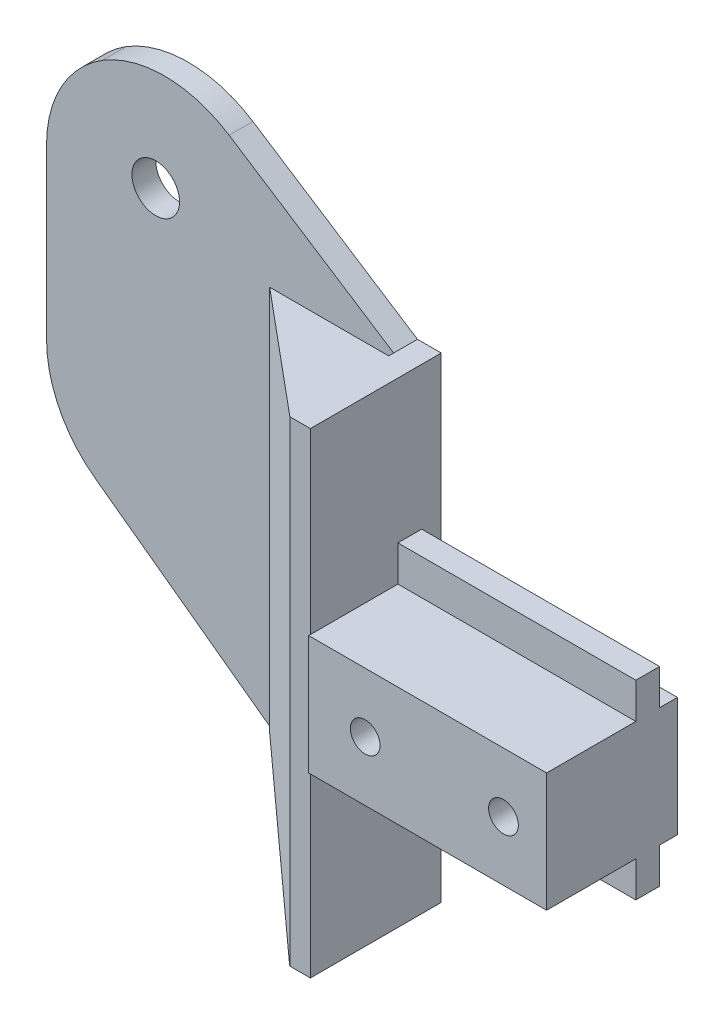
ISO-10303-21;
HEADER;
FILE_DESCRIPTION(('STEP AP214'),'2;1');
FILE_NAME('part.step','',(''),(''),'','','');
FILE_SCHEMA(('AUTOMOTIVE_DESIGN { 1 0 10303 214 1 1 1 1 }'));
ENDSEC;
DATA;
#1=APPLICATION_CONTEXT('core data for automotive mechanical design processes');
#2=APPLICATION_PROTOCOL_DEFINITION('international standard','automotive_design',2000,#1);
#3=PRODUCT_CONTEXT('',#1,'mechanical');
#4=PRODUCT('Part','Part','',(#3));
#5=PRODUCT_RELATED_PRODUCT_CATEGORY('part','',(#4));
#6=PRODUCT_DEFINITION_FORMATION('','',#4);
#7=PRODUCT_DEFINITION_CONTEXT('part definition',#1,'design');
#8=PRODUCT_DEFINITION('design','',#6,#7);
#9=PRODUCT_DEFINITION_SHAPE('','',#8);
#10=(LENGTH_UNIT() NAMED_UNIT(*) SI_UNIT(.MILLI.,.METRE.));
#11=(NAMED_UNIT(*) PLANE_ANGLE_UNIT() SI_UNIT($,.RADIAN.));
#12=(NAMED_UNIT(*) SI_UNIT($,.STERADIAN.) SOLID_ANGLE_UNIT());
#13=UNCERTAINTY_MEASURE_WITH_UNIT(LENGTH_MEASURE(1.E-05),#10,'distance_accuracy_value','');
#14=(GEOMETRIC_REPRESENTATION_CONTEXT(3) GLOBAL_UNCERTAINTY_ASSIGNED_CONTEXT((#13)) GLOBAL_UNIT_ASSIGNED_CONTEXT((#10,
#11,#12)) REPRESENTATION_CONTEXT('',''));
#15=CARTESIAN_POINT('',(0.,0.,0.));
#16=DIRECTION('',(0.,0.,1.));
#17=DIRECTION('',(1.,0.,0.));
#18=AXIS2_PLACEMENT_3D('',#15,#16,#17);
#19=CARTESIAN_POINT('',(-12.,0.,0.));
#20=DIRECTION('',(1.,0.,0.));
#21=DIRECTION('',(0.,0.,-1.));
#22=AXIS2_PLACEMENT_3D('',#19,#20,#21);
#23=PLANE('',#22);
#24=DIRECTION('',(0.,-1.,0.));
#25=VECTOR('',#24,1.);
#26=CARTESIAN_POINT('',(-12.,20.,2.27794764808502));
#27=LINE('',#26,#25);
#28=CARTESIAN_POINT('',(-12.,20.,2.27794764808502));
#29=VERTEX_POINT('',#28);
#30=CARTESIAN_POINT('',(-12.,-19.9305207658601,2.27794764808502));
#31=VERTEX_POINT('',#30);
#32=EDGE_CURVE('E221',#29,#31,#27,.T.);
#33=ORIENTED_EDGE('',*,*,#32,.F.);
#34=DIRECTION('',(0.,0.,-1.));
#35=VECTOR('',#34,1.);
#36=CARTESIAN_POINT('',(-12.,20.,10.8575227914939));
#37=LINE('',#36,#35);
#38=CARTESIAN_POINT('',(-12.,20.,1.85752279149395));
#39=VERTEX_POINT('',#38);
#40=EDGE_CURVE('E268',#29,#39,#37,.T.);
#41=ORIENTED_EDGE('',*,*,#40,.T.);
#42=DIRECTION('',(0.,1.,0.));
#43=VECTOR('',#42,1.);
#44=CARTESIAN_POINT('',(-12.,-20.,1.85752279149395));
#45=LINE('',#44,#43);
#46=CARTESIAN_POINT('',(-12.,-20.,1.85752279149395));
#47=VERTEX_POINT('',#46);
#48=EDGE_CURVE('E259',#47,#39,#45,.T.);
#49=ORIENTED_EDGE('',*,*,#48,.F.);
#50=DIRECTION('',(0.,0.,1.));
#51=VECTOR('',#50,1.);
#52=CARTESIAN_POINT('',(-12.,-20.,10.857522791494));
#53=LINE('',#52,#51);
#54=CARTESIAN_POINT('',(-12.,-20.,2.27794764808502));
#55=VERTEX_POINT('',#54);
#56=EDGE_CURVE('E263',#47,#55,#53,.T.);
#57=ORIENTED_EDGE('',*,*,#56,.T.);
#58=DIRECTION('',(0.,-1.,0.));
#59=VECTOR('',#58,1.);
#60=CARTESIAN_POINT('',(-12.,0.,2.27794764808502));
#61=LINE('',#60,#59);
#62=EDGE_CURVE('E438',#31,#55,#61,.T.);
#63=ORIENTED_EDGE('',*,*,#62,.F.);
#64=EDGE_LOOP('',(#33,#41,#49,#57,#63));
#65=FACE_BOUND('',#64,.T.);
#66=ADVANCED_FACE('F33',(#65),#23,.F.);
#67=CARTESIAN_POINT('',(-10.,5.,11.));
#68=DIRECTION('',(1.,0.,0.));
#69=DIRECTION('',(0.,0.,-1.));
#70=AXIS2_PLACEMENT_3D('',#67,#68,#69);
#71=PLANE('',#70);
#72=DIRECTION('',(0.,1.,0.));
#73=VECTOR('',#72,1.);
#74=CARTESIAN_POINT('',(-10.,20.,10.8575227914939));
#75=LINE('',#74,#73);
#76=CARTESIAN_POINT('',(-10.,-5.,10.857522791494));
#77=VERTEX_POINT('',#76);
#78=CARTESIAN_POINT('',(-10.,5.,10.857522791494));
#79=VERTEX_POINT('',#78);
#80=EDGE_CURVE('E280',#77,#79,#75,.T.);
#81=ORIENTED_EDGE('',*,*,#80,.F.);
#82=DIRECTION('',(0.,0.,-1.));
#83=VECTOR('',#82,1.);
#84=CARTESIAN_POINT('',(-10.,-5.,11.));
#85=LINE('',#84,#83);
#86=CARTESIAN_POINT('',(-10.,-5.,11.));
#87=VERTEX_POINT('',#86);
#88=EDGE_CURVE('E366',#87,#77,#85,.T.);
#89=ORIENTED_EDGE('',*,*,#88,.F.);
#90=DIRECTION('',(0.,-1.,0.));
#91=VECTOR('',#90,1.);
#92=CARTESIAN_POINT('',(-10.,5.,11.));
#93=LINE('',#92,#91);
#94=CARTESIAN_POINT('',(-10.,5.,11.));
#95=VERTEX_POINT('',#94);
#96=EDGE_CURVE('E334',#95,#87,#93,.T.);
#97=ORIENTED_EDGE('',*,*,#96,.F.);
#98=DIRECTION('',(0.,0.,-1.));
#99=VECTOR('',#98,1.);
#100=CARTESIAN_POINT('',(-10.,5.,11.));
#101=LINE('',#100,#99);
#102=EDGE_CURVE('E354',#95,#79,#101,.T.);
#103=ORIENTED_EDGE('',*,*,#102,.T.);
#104=EDGE_LOOP('',(#81,#89,#97,#103));
#105=FACE_BOUND('',#104,.T.);
#106=ADVANCED_FACE('F461',(#105),#71,.F.);
#107=CARTESIAN_POINT('',(10.,-5.,11.));
#108=DIRECTION('',(0.,1.,0.));
#109=DIRECTION('',(0.,0.,1.));
#110=AXIS2_PLACEMENT_3D('',#107,#108,#109);
#111=PLANE('',#110);
#112=ORIENTED_EDGE('',*,*,#88,.T.);
#113=CARTESIAN_POINT('',(-10.,-5.,3.5));
#114=VERTEX_POINT('',#113);
#115=EDGE_CURVE('E370',#77,#114,#85,.T.);
#116=ORIENTED_EDGE('',*,*,#115,.T.);
#117=DIRECTION('',(1.,0.,0.));
#118=VECTOR('',#117,1.);
#119=CARTESIAN_POINT('',(10.,-5.,3.5));
#120=LINE('',#119,#118);
#121=CARTESIAN_POINT('',(10.,-5.,3.5));
#122=VERTEX_POINT('',#121);
#123=EDGE_CURVE('E330',#114,#122,#120,.T.);
#124=ORIENTED_EDGE('',*,*,#123,.T.);
#125=DIRECTION('',(0.,0.,-1.));
#126=VECTOR('',#125,1.);
#127=CARTESIAN_POINT('',(10.,-5.,11.));
#128=LINE('',#127,#126);
#129=CARTESIAN_POINT('',(10.,-5.,11.));
#130=VERTEX_POINT('',#129);
#131=EDGE_CURVE('E362',#130,#122,#128,.T.);
#132=ORIENTED_EDGE('',*,*,#131,.F.);
#133=DIRECTION('',(1.,0.,0.));
#134=VECTOR('',#133,1.);
#135=CARTESIAN_POINT('',(10.,-5.,11.));
#136=LINE('',#135,#134);
#137=EDGE_CURVE('E337',#87,#130,#136,.T.);
#138=ORIENTED_EDGE('',*,*,#137,.F.);
#139=EDGE_LOOP('',(#112,#116,#124,#132,#138));
#140=FACE_BOUND('',#139,.T.);
#141=ADVANCED_FACE('F466',(#140),#111,.F.);
#142=CARTESIAN_POINT('',(10.,5.,11.));
#143=DIRECTION('',(0.,-1.,0.));
#144=DIRECTION('',(0.,0.,-1.));
#145=AXIS2_PLACEMENT_3D('',#142,#143,#144);
#146=PLANE('',#145);
#147=DIRECTION('',(0.,0.,-1.));
#148=VECTOR('',#147,1.);
#149=CARTESIAN_POINT('',(10.,5.,11.));
#150=LINE('',#149,#148);
#151=CARTESIAN_POINT('',(10.,5.,11.));
#152=VERTEX_POINT('',#151);
#153=CARTESIAN_POINT('',(10.,5.,3.5));
#154=VERTEX_POINT('',#153);
#155=EDGE_CURVE('E358',#152,#154,#150,.T.);
#156=ORIENTED_EDGE('',*,*,#155,.T.);
#157=DIRECTION('',(-1.,0.,0.));
#158=VECTOR('',#157,1.);
#159=CARTESIAN_POINT('',(10.,5.,3.5));
#160=LINE('',#159,#158);
#161=CARTESIAN_POINT('',(-10.,5.,3.5));
#162=VERTEX_POINT('',#161);
#163=EDGE_CURVE('E373',#154,#162,#160,.T.);
#164=ORIENTED_EDGE('',*,*,#163,.T.);
#165=EDGE_CURVE('E357',#79,#162,#101,.T.);
#166=ORIENTED_EDGE('',*,*,#165,.F.);
#167=ORIENTED_EDGE('',*,*,#102,.F.);
#168=DIRECTION('',(-1.,0.,0.));
#169=VECTOR('',#168,1.);
#170=CARTESIAN_POINT('',(10.,5.,11.));
#171=LINE('',#170,#169);
#172=EDGE_CURVE('E342',#152,#95,#171,.T.);
#173=ORIENTED_EDGE('',*,*,#172,.F.);
#174=EDGE_LOOP('',(#156,#164,#166,#167,#173));
#175=FACE_BOUND('',#174,.T.);
#176=ADVANCED_FACE('F475',(#175),#146,.F.);
#177=CARTESIAN_POINT('',(10.,-5.,1.5));
#178=VERTEX_POINT('',#177);
#179=CARTESIAN_POINT('',(10.,-5.,0.));
#180=VERTEX_POINT('',#179);
#181=EDGE_CURVE('E361',#178,#180,#128,.T.);
#182=ORIENTED_EDGE('',*,*,#181,.F.);
#183=DIRECTION('',(-1.,0.,0.));
#184=VECTOR('',#183,1.);
#185=CARTESIAN_POINT('',(10.,-5.,1.5));
#186=LINE('',#185,#184);
#187=CARTESIAN_POINT('',(-10.,-5.,1.5));
#188=VERTEX_POINT('',#187);
#189=EDGE_CURVE('E316',#178,#188,#186,.T.);
#190=ORIENTED_EDGE('',*,*,#189,.T.);
#191=CARTESIAN_POINT('',(-10.,-5.,0.));
#192=VERTEX_POINT('',#191);
#193=EDGE_CURVE('E365',#188,#192,#85,.T.);
#194=ORIENTED_EDGE('',*,*,#193,.T.);
#195=DIRECTION('',(1.,0.,0.));
#196=VECTOR('',#195,1.);
#197=CARTESIAN_POINT('',(10.,-5.,0.));
#198=LINE('',#197,#196);
#199=EDGE_CURVE('E347',#192,#180,#198,.T.);
#200=ORIENTED_EDGE('',*,*,#199,.T.);
#201=EDGE_LOOP('',(#182,#190,#194,#200));
#202=FACE_BOUND('',#201,.T.);
#203=ADVANCED_FACE('F563',(#202),#111,.F.);
#204=CARTESIAN_POINT('',(10.,5.,11.));
#205=DIRECTION('',(-1.,0.,0.));
#206=DIRECTION('',(0.,0.,1.));
#207=AXIS2_PLACEMENT_3D('',#204,#205,#206);
#208=PLANE('',#207);
#209=CARTESIAN_POINT('',(10.,5.,1.5));
#210=VERTEX_POINT('',#209);
#211=CARTESIAN_POINT('',(10.,5.,0.));
#212=VERTEX_POINT('',#211);
#213=EDGE_CURVE('E356',#210,#212,#150,.T.);
#214=ORIENTED_EDGE('',*,*,#213,.F.);
#215=DIRECTION('',(0.,1.,0.));
#216=VECTOR('',#215,1.);
#217=CARTESIAN_POINT('',(10.,-8.,1.5));
#218=LINE('',#217,#216);
#219=CARTESIAN_POINT('',(10.,8.,1.5));
#220=VERTEX_POINT('',#219);
#221=EDGE_CURVE('E313',#210,#220,#218,.T.);
#222=ORIENTED_EDGE('',*,*,#221,.T.);
#223=DIRECTION('',(0.,0.,-1.));
#224=VECTOR('',#223,1.);
#225=CARTESIAN_POINT('',(10.,8.,1.5));
#226=LINE('',#225,#224);
#227=CARTESIAN_POINT('',(10.,8.,3.5));
#228=VERTEX_POINT('',#227);
#229=EDGE_CURVE('E290',#228,#220,#226,.T.);
#230=ORIENTED_EDGE('',*,*,#229,.F.);
#231=DIRECTION('',(0.,1.,0.));
#232=VECTOR('',#231,1.);
#233=CARTESIAN_POINT('',(10.,-8.,3.5));
#234=LINE('',#233,#232);
#235=EDGE_CURVE('E317',#154,#228,#234,.T.);
#236=ORIENTED_EDGE('',*,*,#235,.F.);
#237=ORIENTED_EDGE('',*,*,#155,.F.);
#238=DIRECTION('',(0.,1.,0.));
#239=VECTOR('',#238,1.);
#240=CARTESIAN_POINT('',(10.,5.,11.));
#241=LINE('',#240,#239);
#242=EDGE_CURVE('E340',#130,#152,#241,.T.);
#243=ORIENTED_EDGE('',*,*,#242,.F.);
#244=ORIENTED_EDGE('',*,*,#131,.T.);
#245=CARTESIAN_POINT('',(10.,-8.,3.5));
#246=VERTEX_POINT('',#245);
#247=EDGE_CURVE('E314',#246,#122,#234,.T.);
#248=ORIENTED_EDGE('',*,*,#247,.F.);
#249=DIRECTION('',(0.,0.,-1.));
#250=VECTOR('',#249,1.);
#251=CARTESIAN_POINT('',(10.,-8.,1.5));
#252=LINE('',#251,#250);
#253=CARTESIAN_POINT('',(10.,-8.,1.5));
#254=VERTEX_POINT('',#253);
#255=EDGE_CURVE('E301',#246,#254,#252,.T.);
#256=ORIENTED_EDGE('',*,*,#255,.T.);
#257=EDGE_CURVE('E325',#254,#178,#218,.T.);
#258=ORIENTED_EDGE('',*,*,#257,.T.);
#259=ORIENTED_EDGE('',*,*,#181,.T.);
#260=DIRECTION('',(0.,1.,0.));
#261=VECTOR('',#260,1.);
#262=CARTESIAN_POINT('',(10.,5.,0.));
#263=LINE('',#262,#261);
#264=EDGE_CURVE('E350',#180,#212,#263,.T.);
#265=ORIENTED_EDGE('',*,*,#264,.T.);
#266=EDGE_LOOP('',(#214,#222,#230,#236,#237,#243,#244,#248,#256,#258,#259,#265));
#267=FACE_BOUND('',#266,.T.);
#268=ADVANCED_FACE('F559',(#267),#208,.F.);
#269=CARTESIAN_POINT('',(-10.,5.,1.5));
#270=VERTEX_POINT('',#269);
#271=CARTESIAN_POINT('',(-10.,5.,0.));
#272=VERTEX_POINT('',#271);
#273=EDGE_CURVE('E344',#270,#272,#101,.T.);
#274=ORIENTED_EDGE('',*,*,#273,.F.);
#275=DIRECTION('',(1.,0.,0.));
#276=VECTOR('',#275,1.);
#277=CARTESIAN_POINT('',(10.,5.,1.5));
#278=LINE('',#277,#276);
#279=EDGE_CURVE('E369',#270,#210,#278,.T.);
#280=ORIENTED_EDGE('',*,*,#279,.T.);
#281=ORIENTED_EDGE('',*,*,#213,.T.);
#282=DIRECTION('',(-1.,0.,0.));
#283=VECTOR('',#282,1.);
#284=CARTESIAN_POINT('',(10.,5.,0.));
#285=LINE('',#284,#283);
#286=EDGE_CURVE('E338',#212,#272,#285,.T.);
#287=ORIENTED_EDGE('',*,*,#286,.T.);
#288=EDGE_LOOP('',(#274,#280,#281,#287));
#289=FACE_BOUND('',#288,.T.);
#290=ADVANCED_FACE('F502',(#289),#146,.F.);
#291=CARTESIAN_POINT('',(0.,0.,11.));
#292=DIRECTION('',(0.,0.,-1.));
#293=DIRECTION('',(-1.,0.,0.));
#294=AXIS2_PLACEMENT_3D('',#291,#292,#293);
#295=PLANE('',#294);
#296=CARTESIAN_POINT('',(-5.25071513814623,0.,11.));
#297=DIRECTION('',(0.,0.,1.));
#298=DIRECTION('',(1.,0.,0.));
#299=AXIS2_PLACEMENT_3D('',#296,#297,#298);
#300=CIRCLE('',#299,1.25);
#301=CARTESIAN_POINT('',(-4.00071513814623,0.,11.));
#302=VERTEX_POINT('',#301);
#303=EDGE_CURVE('E493',#302,#302,#300,.T.);
#304=ORIENTED_EDGE('',*,*,#303,.F.);
#305=EDGE_LOOP('',(#304));
#306=FACE_BOUND('',#305,.T.);
#307=CARTESIAN_POINT('',(6.37413019934741,0.,11.));
#308=DIRECTION('',(0.,0.,1.));
#309=DIRECTION('',(1.,0.,0.));
#310=AXIS2_PLACEMENT_3D('',#307,#308,#309);
#311=CIRCLE('',#310,1.25);
#312=CARTESIAN_POINT('',(7.6241301993474,0.,11.));
#313=VERTEX_POINT('',#312);
#314=EDGE_CURVE('E484',#313,#313,#311,.T.);
#315=ORIENTED_EDGE('',*,*,#314,.F.);
#316=EDGE_LOOP('',(#315));
#317=FACE_BOUND('',#316,.T.);
#318=ORIENTED_EDGE('',*,*,#96,.T.);
#319=ORIENTED_EDGE('',*,*,#137,.T.);
#320=ORIENTED_EDGE('',*,*,#242,.T.);
#321=ORIENTED_EDGE('',*,*,#172,.T.);
#322=EDGE_LOOP('',(#318,#319,#320,#321));
#323=FACE_BOUND('',#322,.T.);
#324=ADVANCED_FACE('F471',(#306,#317,#323),#295,.F.);
#325=CARTESIAN_POINT('',(0.,0.,0.));
#326=DIRECTION('',(0.,0.,-1.));
#327=DIRECTION('',(-1.,0.,0.));
#328=AXIS2_PLACEMENT_3D('',#325,#326,#327);
#329=PLANE('',#328);
#330=CARTESIAN_POINT('',(-5.25071513814623,0.,0.));
#331=DIRECTION('',(0.,0.,-1.));
#332=DIRECTION('',(-1.,0.,0.));
#333=AXIS2_PLACEMENT_3D('',#330,#331,#332);
#334=CIRCLE('',#333,1.25);
#335=CARTESIAN_POINT('',(-6.50071513814623,0.,0.));
#336=VERTEX_POINT('',#335);
#337=EDGE_CURVE('E488',#336,#336,#334,.T.);
#338=ORIENTED_EDGE('',*,*,#337,.F.);
#339=EDGE_LOOP('',(#338));
#340=FACE_BOUND('',#339,.T.);
#341=CARTESIAN_POINT('',(6.37413019934741,0.,0.));
#342=DIRECTION('',(0.,0.,-1.));
#343=DIRECTION('',(-1.,0.,0.));
#344=AXIS2_PLACEMENT_3D('',#341,#342,#343);
#345=CIRCLE('',#344,1.25);
#346=CARTESIAN_POINT('',(5.12413019934741,0.,0.));
#347=VERTEX_POINT('',#346);
#348=EDGE_CURVE('E482',#347,#347,#345,.T.);
#349=ORIENTED_EDGE('',*,*,#348,.F.);
#350=EDGE_LOOP('',(#349));
#351=FACE_BOUND('',#350,.T.);
#352=DIRECTION('',(0.,-1.,0.));
#353=VECTOR('',#352,1.);
#354=CARTESIAN_POINT('',(-10.,5.,0.));
#355=LINE('',#354,#353);
#356=EDGE_CURVE('E333',#272,#192,#355,.T.);
#357=ORIENTED_EDGE('',*,*,#356,.F.);
#358=ORIENTED_EDGE('',*,*,#286,.F.);
#359=ORIENTED_EDGE('',*,*,#264,.F.);
#360=ORIENTED_EDGE('',*,*,#199,.F.);
#361=EDGE_LOOP('',(#357,#358,#359,#360));
#362=FACE_BOUND('',#361,.T.);
#363=ADVANCED_FACE('F501',(#340,#351,#362),#329,.T.);
#364=CARTESIAN_POINT('',(0.,8.,0.));
#365=DIRECTION('',(0.,1.,0.));
#366=DIRECTION('',(0.,0.,1.));
#367=AXIS2_PLACEMENT_3D('',#364,#365,#366);
#368=PLANE('',#367);
#369=ORIENTED_EDGE('',*,*,#229,.T.);
#370=DIRECTION('',(-1.,0.,0.));
#371=VECTOR('',#370,1.);
#372=CARTESIAN_POINT('',(-10.,8.,1.5));
#373=LINE('',#372,#371);
#374=CARTESIAN_POINT('',(-10.,8.,1.5));
#375=VERTEX_POINT('',#374);
#376=EDGE_CURVE('E293',#220,#375,#373,.T.);
#377=ORIENTED_EDGE('',*,*,#376,.T.);
#378=DIRECTION('',(0.,0.,1.));
#379=VECTOR('',#378,1.);
#380=CARTESIAN_POINT('',(-10.,8.,1.5));
#381=LINE('',#380,#379);
#382=CARTESIAN_POINT('',(-10.,8.,3.5));
#383=VERTEX_POINT('',#382);
#384=EDGE_CURVE('E296',#375,#383,#381,.T.);
#385=ORIENTED_EDGE('',*,*,#384,.T.);
#386=DIRECTION('',(1.,0.,0.));
#387=VECTOR('',#386,1.);
#388=CARTESIAN_POINT('',(-10.,8.,3.5));
#389=LINE('',#388,#387);
#390=EDGE_CURVE('E298',#383,#228,#389,.T.);
#391=ORIENTED_EDGE('',*,*,#390,.T.);
#392=EDGE_LOOP('',(#369,#377,#385,#391));
#393=FACE_BOUND('',#392,.T.);
#394=ADVANCED_FACE('F537',(#393),#368,.T.);
#395=CARTESIAN_POINT('',(-10.,-8.,1.5));
#396=DIRECTION('',(0.,0.,-1.));
#397=DIRECTION('',(-1.,0.,0.));
#398=AXIS2_PLACEMENT_3D('',#395,#396,#397);
#399=PLANE('',#398);
#400=ORIENTED_EDGE('',*,*,#279,.F.);
#401=DIRECTION('',(0.,1.,0.));
#402=VECTOR('',#401,1.);
#403=CARTESIAN_POINT('',(-10.,-8.,1.5));
#404=LINE('',#403,#402);
#405=EDGE_CURVE('E324',#270,#375,#404,.T.);
#406=ORIENTED_EDGE('',*,*,#405,.T.);
#407=ORIENTED_EDGE('',*,*,#376,.F.);
#408=ORIENTED_EDGE('',*,*,#221,.F.);
#409=EDGE_LOOP('',(#400,#406,#407,#408));
#410=FACE_BOUND('',#409,.T.);
#411=ADVANCED_FACE('F540',(#410),#399,.T.);
#412=CARTESIAN_POINT('',(-10.,-8.,3.5));
#413=DIRECTION('',(0.,0.,1.));
#414=DIRECTION('',(1.,0.,0.));
#415=AXIS2_PLACEMENT_3D('',#412,#413,#414);
#416=PLANE('',#415);
#417=ORIENTED_EDGE('',*,*,#163,.F.);
#418=ORIENTED_EDGE('',*,*,#235,.T.);
#419=ORIENTED_EDGE('',*,*,#390,.F.);
#420=DIRECTION('',(0.,1.,0.));
#421=VECTOR('',#420,1.);
#422=CARTESIAN_POINT('',(-10.,-8.,3.5));
#423=LINE('',#422,#421);
#424=EDGE_CURVE('E321',#162,#383,#423,.T.);
#425=ORIENTED_EDGE('',*,*,#424,.F.);
#426=EDGE_LOOP('',(#417,#418,#419,#425));
#427=FACE_BOUND('',#426,.T.);
#428=ADVANCED_FACE('F549',(#427),#416,.T.);
#429=ORIENTED_EDGE('',*,*,#123,.F.);
#430=CARTESIAN_POINT('',(-10.,-8.,3.5));
#431=VERTEX_POINT('',#430);
#432=EDGE_CURVE('E318',#431,#114,#423,.T.);
#433=ORIENTED_EDGE('',*,*,#432,.F.);
#434=DIRECTION('',(1.,0.,0.));
#435=VECTOR('',#434,1.);
#436=CARTESIAN_POINT('',(-10.,-8.,3.5));
#437=LINE('',#436,#435);
#438=EDGE_CURVE('E310',#431,#246,#437,.T.);
#439=ORIENTED_EDGE('',*,*,#438,.T.);
#440=ORIENTED_EDGE('',*,*,#247,.T.);
#441=EDGE_LOOP('',(#429,#433,#439,#440));
#442=FACE_BOUND('',#441,.T.);
#443=ADVANCED_FACE('F546',(#442),#416,.T.);
#444=ORIENTED_EDGE('',*,*,#189,.F.);
#445=ORIENTED_EDGE('',*,*,#257,.F.);
#446=DIRECTION('',(-1.,0.,0.));
#447=VECTOR('',#446,1.);
#448=CARTESIAN_POINT('',(-10.,-8.,1.5));
#449=LINE('',#448,#447);
#450=CARTESIAN_POINT('',(-10.,-8.,1.5));
#451=VERTEX_POINT('',#450);
#452=EDGE_CURVE('E304',#254,#451,#449,.T.);
#453=ORIENTED_EDGE('',*,*,#452,.T.);
#454=EDGE_CURVE('E322',#451,#188,#404,.T.);
#455=ORIENTED_EDGE('',*,*,#454,.T.);
#456=EDGE_LOOP('',(#444,#445,#453,#455));
#457=FACE_BOUND('',#456,.T.);
#458=ADVANCED_FACE('F544',(#457),#399,.T.);
#459=CARTESIAN_POINT('',(0.,-8.,0.));
#460=DIRECTION('',(0.,1.,0.));
#461=DIRECTION('',(0.,0.,1.));
#462=AXIS2_PLACEMENT_3D('',#459,#460,#461);
#463=PLANE('',#462);
#464=ORIENTED_EDGE('',*,*,#255,.F.);
#465=ORIENTED_EDGE('',*,*,#438,.F.);
#466=DIRECTION('',(0.,0.,1.));
#467=VECTOR('',#466,1.);
#468=CARTESIAN_POINT('',(-10.,-8.,1.5));
#469=LINE('',#468,#467);
#470=EDGE_CURVE('E307',#451,#431,#469,.T.);
#471=ORIENTED_EDGE('',*,*,#470,.F.);
#472=ORIENTED_EDGE('',*,*,#452,.F.);
#473=EDGE_LOOP('',(#464,#465,#471,#472));
#474=FACE_BOUND('',#473,.T.);
#475=ADVANCED_FACE('F527',(#474),#463,.F.);
#476=CARTESIAN_POINT('',(-10.,0.,0.));
#477=DIRECTION('',(1.,0.,0.));
#478=DIRECTION('',(0.,0.,-1.));
#479=AXIS2_PLACEMENT_3D('',#476,#477,#478);
#480=PLANE('',#479);
#481=ORIENTED_EDGE('',*,*,#115,.F.);
#482=CARTESIAN_POINT('',(-10.,-20.,10.857522791494));
#483=VERTEX_POINT('',#482);
#484=EDGE_CURVE('E277',#483,#77,#75,.T.);
#485=ORIENTED_EDGE('',*,*,#484,.F.);
#486=DIRECTION('',(0.,0.,1.));
#487=VECTOR('',#486,1.);
#488=CARTESIAN_POINT('',(-10.,-20.,10.857522791494));
#489=LINE('',#488,#487);
#490=CARTESIAN_POINT('',(-10.,-20.,-0.142477208506051));
#491=VERTEX_POINT('',#490);
#492=EDGE_CURVE('E273',#491,#483,#489,.T.);
#493=ORIENTED_EDGE('',*,*,#492,.F.);
#494=DIRECTION('',(0.,-1.,0.));
#495=VECTOR('',#494,1.);
#496=CARTESIAN_POINT('',(-10.,20.,-0.142477208506051));
#497=LINE('',#496,#495);
#498=CARTESIAN_POINT('',(-10.,20.,-0.142477208506051));
#499=VERTEX_POINT('',#498);
#500=EDGE_CURVE('E262',#499,#491,#497,.T.);
#501=ORIENTED_EDGE('',*,*,#500,.F.);
#502=DIRECTION('',(0.,0.,-1.));
#503=VECTOR('',#502,1.);
#504=CARTESIAN_POINT('',(-10.,20.,10.8575227914939));
#505=LINE('',#504,#503);
#506=CARTESIAN_POINT('',(-10.,20.,10.8575227914939));
#507=VERTEX_POINT('',#506);
#508=EDGE_CURVE('E267',#507,#499,#505,.T.);
#509=ORIENTED_EDGE('',*,*,#508,.F.);
#510=EDGE_CURVE('E276',#79,#507,#75,.T.);
#511=ORIENTED_EDGE('',*,*,#510,.F.);
#512=ORIENTED_EDGE('',*,*,#165,.T.);
#513=ORIENTED_EDGE('',*,*,#424,.T.);
#514=ORIENTED_EDGE('',*,*,#384,.F.);
#515=ORIENTED_EDGE('',*,*,#405,.F.);
#516=ORIENTED_EDGE('',*,*,#273,.T.);
#517=ORIENTED_EDGE('',*,*,#356,.T.);
#518=ORIENTED_EDGE('',*,*,#193,.F.);
#519=ORIENTED_EDGE('',*,*,#454,.F.);
#520=ORIENTED_EDGE('',*,*,#470,.T.);
#521=ORIENTED_EDGE('',*,*,#432,.T.);
#522=EDGE_LOOP('',(#481,#485,#493,#501,#509,#511,#512,#513,#514,#515,#516,#517,#518,#519,#520,#521));
#523=FACE_BOUND('',#522,.T.);
#524=ADVANCED_FACE('F455',(#523),#480,.T.);
#525=CARTESIAN_POINT('',(-12.,20.,-0.142477208506051));
#526=DIRECTION('',(0.,0.,1.));
#527=DIRECTION('',(0.,-1.,0.));
#528=AXIS2_PLACEMENT_3D('',#525,#526,#527);
#529=PLANE('',#528);
#530=CARTESIAN_POINT('',(-32.,22.,-0.142477208506051));
#531=DIRECTION('',(0.,0.,-1.));
#532=DIRECTION('',(0.,1.,0.));
#533=AXIS2_PLACEMENT_3D('',#530,#531,#532);
#534=CIRCLE('',#533,2.);
#535=CARTESIAN_POINT('',(-32.,24.,-0.142477208506051));
#536=VERTEX_POINT('',#535);
#537=EDGE_CURVE('E253',#536,#536,#534,.T.);
#538=ORIENTED_EDGE('',*,*,#537,.F.);
#539=EDGE_LOOP('',(#538));
#540=FACE_BOUND('',#539,.T.);
#541=DIRECTION('',(-0.807460810682261,0.589921214411167,0.));
#542=VECTOR('',#541,1.);
#543=CARTESIAN_POINT('',(-31.0535304810842,-6.07971843150617,-0.142477208506051));
#544=LINE('',#543,#542);
#545=CARTESIAN_POINT('',(-12.,-20.,-0.142477208506048));
#546=VERTEX_POINT('',#545);
#547=CARTESIAN_POINT('',(-37.0782032210872,-1.67816455769102,-0.142477208506051));
#548=VERTEX_POINT('',#547);
#549=EDGE_CURVE('E247',#546,#548,#544,.T.);
#550=ORIENTED_EDGE('',*,*,#549,.T.);
#551=CARTESIAN_POINT('',(-31.1789910769755,6.3964435491316,-0.142477208506055));
#552=DIRECTION('',(0.,0.,1.));
#553=DIRECTION('',(0.,-1.,0.));
#554=AXIS2_PLACEMENT_3D('',#551,#552,#553);
#555=CIRCLE('',#554,10.);
#556=CARTESIAN_POINT('',(-41.1789910769755,6.3964435491316,-0.142477208506051));
#557=VERTEX_POINT('',#556);
#558=EDGE_CURVE('E393',#548,#557,#555,.F.);
#559=ORIENTED_EDGE('',*,*,#558,.T.);
#560=DIRECTION('',(0.,1.,0.));
#561=VECTOR('',#560,1.);
#562=CARTESIAN_POINT('',(-41.1789910769755,20.,-0.142477208506051));
#563=LINE('',#562,#561);
#564=CARTESIAN_POINT('',(-41.1789910769755,20.593205165727,-0.142477208506055));
#565=VERTEX_POINT('',#564);
#566=EDGE_CURVE('E239',#557,#565,#563,.T.);
#567=ORIENTED_EDGE('',*,*,#566,.T.);
#568=CARTESIAN_POINT('',(-31.1789910769755,20.593205165727,-0.142477208506055));
#569=DIRECTION('',(0.,0.,1.));
#570=DIRECTION('',(0.,-1.,0.));
#571=AXIS2_PLACEMENT_3D('',#568,#569,#570);
#572=CIRCLE('',#571,10.);
#573=CARTESIAN_POINT('',(-36.4787346627521,29.0733418347329,-0.142477208506051));
#574=VERTEX_POINT('',#573);
#575=EDGE_CURVE('E391',#565,#574,#572,.F.);
#576=ORIENTED_EDGE('',*,*,#575,.T.);
#577=CARTESIAN_POINT('',(-31.2605226506188,20.542793001485,-0.142477208506055));
#578=DIRECTION('',(0.,0.,1.));
#579=DIRECTION('',(0.,-1.,0.));
#580=AXIS2_PLACEMENT_3D('',#577,#578,#579);
#581=CIRCLE('',#580,10.);
#582=CARTESIAN_POINT('',(-25.831880413124,28.9409977773456,-0.142477208506051));
#583=VERTEX_POINT('',#582);
#584=EDGE_CURVE('E382',#574,#583,#581,.F.);
#585=ORIENTED_EDGE('',*,*,#584,.T.);
#586=DIRECTION('',(-0.839820477586057,0.542864223749482,0.));
#587=VECTOR('',#586,1.);
#588=CARTESIAN_POINT('',(-12.,20.,-0.142477208506051));
#589=LINE('',#588,#587);
#590=CARTESIAN_POINT('',(-12.,20.,-0.142477208506051));
#591=VERTEX_POINT('',#590);
#592=EDGE_CURVE('E250',#591,#583,#589,.T.);
#593=ORIENTED_EDGE('',*,*,#592,.F.);
#594=DIRECTION('',(1.,0.,0.));
#595=VECTOR('',#594,1.);
#596=CARTESIAN_POINT('',(-12.,20.,-0.142477208506051));
#597=LINE('',#596,#595);
#598=EDGE_CURVE('E270',#591,#499,#597,.T.);
#599=ORIENTED_EDGE('',*,*,#598,.T.);
#600=ORIENTED_EDGE('',*,*,#500,.T.);
#601=DIRECTION('',(1.,0.,0.));
#602=VECTOR('',#601,1.);
#603=CARTESIAN_POINT('',(-12.,-20.,-0.142477208506051));
#604=LINE('',#603,#602);
#605=EDGE_CURVE('E288',#546,#491,#604,.T.);
#606=ORIENTED_EDGE('',*,*,#605,.F.);
#607=EDGE_LOOP('',(#550,#559,#567,#576,#585,#593,#599,#600,#606));
#608=FACE_BOUND('',#607,.T.);
#609=ADVANCED_FACE('F412',(#540,#608),#529,.F.);
#610=CARTESIAN_POINT('',(-12.,-20.,10.857522791494));
#611=DIRECTION('',(0.,1.,0.));
#612=DIRECTION('',(0.,0.,1.));
#613=AXIS2_PLACEMENT_3D('',#610,#611,#612);
#614=PLANE('',#613);
#615=DIRECTION('',(0.767587633094092,0.,0.640944011221736));
#616=VECTOR('',#615,1.);
#617=CARTESIAN_POINT('',(-22.,-20.,2.27794764808502));
#618=LINE('',#617,#616);
#619=CARTESIAN_POINT('',(-11.9069763312361,-20.,10.7057320426005));
#620=VERTEX_POINT('',#619);
#621=CARTESIAN_POINT('',(-11.725193367937,-20.,10.857522791494));
#622=VERTEX_POINT('',#621);
#623=EDGE_CURVE('E443',#620,#622,#618,.T.);
#624=ORIENTED_EDGE('',*,*,#623,.F.);
#625=DIRECTION('',(0.,0.,-1.));
#626=VECTOR('',#625,1.);
#627=CARTESIAN_POINT('',(-11.9069763312361,-20.,42.277947648085));
#628=LINE('',#627,#626);
#629=CARTESIAN_POINT('',(-11.9069763312361,-20.,2.27794764808502));
#630=VERTEX_POINT('',#629);
#631=EDGE_CURVE('E48',#620,#630,#628,.T.);
#632=ORIENTED_EDGE('',*,*,#631,.T.);
#633=DIRECTION('',(-1.,0.,0.));
#634=VECTOR('',#633,1.);
#635=CARTESIAN_POINT('',(-22.,-20.,2.27794764808502));
#636=LINE('',#635,#634);
#637=EDGE_CURVE('E222',#630,#55,#636,.T.);
#638=ORIENTED_EDGE('',*,*,#637,.T.);
#639=ORIENTED_EDGE('',*,*,#56,.F.);
#640=DIRECTION('',(0.,0.,1.));
#641=VECTOR('',#640,1.);
#642=CARTESIAN_POINT('',(-12.,-20.,-38.1424772085061));
#643=LINE('',#642,#641);
#644=EDGE_CURVE('E245',#546,#47,#643,.T.);
#645=ORIENTED_EDGE('',*,*,#644,.F.);
#646=ORIENTED_EDGE('',*,*,#605,.T.);
#647=ORIENTED_EDGE('',*,*,#492,.T.);
#648=DIRECTION('',(1.,0.,0.));
#649=VECTOR('',#648,1.);
#650=CARTESIAN_POINT('',(-12.,-20.,10.857522791494));
#651=LINE('',#650,#649);
#652=EDGE_CURVE('E286',#622,#483,#651,.T.);
#653=ORIENTED_EDGE('',*,*,#652,.F.);
#654=EDGE_LOOP('',(#624,#632,#638,#639,#645,#646,#647,#653));
#655=FACE_BOUND('',#654,.T.);
#656=ADVANCED_FACE('F434',(#655),#614,.F.);
#657=CARTESIAN_POINT('',(-12.,20.,10.8575227914939));
#658=DIRECTION('',(0.,0.,-1.));
#659=DIRECTION('',(0.,1.,0.));
#660=AXIS2_PLACEMENT_3D('',#657,#658,#659);
#661=PLANE('',#660);
#662=DIRECTION('',(1.,0.,0.));
#663=VECTOR('',#662,1.);
#664=CARTESIAN_POINT('',(-12.,20.,10.8575227914939));
#665=LINE('',#664,#663);
#666=CARTESIAN_POINT('',(-11.725193367937,20.,10.857522791494));
#667=VERTEX_POINT('',#666);
#668=EDGE_CURVE('E284',#667,#507,#665,.T.);
#669=ORIENTED_EDGE('',*,*,#668,.F.);
#670=DIRECTION('',(0.,-1.,0.));
#671=VECTOR('',#670,1.);
#672=CARTESIAN_POINT('',(-11.725193367937,20.,10.857522791494));
#673=LINE('',#672,#671);
#674=EDGE_CURVE('E233',#667,#622,#673,.T.);
#675=ORIENTED_EDGE('',*,*,#674,.T.);
#676=ORIENTED_EDGE('',*,*,#652,.T.);
#677=ORIENTED_EDGE('',*,*,#484,.T.);
#678=ORIENTED_EDGE('',*,*,#80,.T.);
#679=ORIENTED_EDGE('',*,*,#510,.T.);
#680=EDGE_LOOP('',(#669,#675,#676,#677,#678,#679));
#681=FACE_BOUND('',#680,.T.);
#682=ADVANCED_FACE('F448',(#681),#661,.F.);
#683=CARTESIAN_POINT('',(-12.,20.,10.8575227914939));
#684=DIRECTION('',(0.,-1.,0.));
#685=DIRECTION('',(0.,0.,-1.));
#686=AXIS2_PLACEMENT_3D('',#683,#684,#685);
#687=PLANE('',#686);
#688=DIRECTION('',(1.,0.,0.));
#689=VECTOR('',#688,1.);
#690=CARTESIAN_POINT('',(-22.,20.,2.27794764808502));
#691=LINE('',#690,#689);
#692=CARTESIAN_POINT('',(-22.,20.,2.27794764808502));
#693=VERTEX_POINT('',#692);
#694=EDGE_CURVE('E229',#693,#29,#691,.T.);
#695=ORIENTED_EDGE('',*,*,#694,.F.);
#696=DIRECTION('',(0.767587633094092,0.,0.640944011221736));
#697=VECTOR('',#696,1.);
#698=CARTESIAN_POINT('',(-22.,20.,2.27794764808502));
#699=LINE('',#698,#697);
#700=EDGE_CURVE('E227',#693,#667,#699,.T.);
#701=ORIENTED_EDGE('',*,*,#700,.T.);
#702=ORIENTED_EDGE('',*,*,#668,.T.);
#703=ORIENTED_EDGE('',*,*,#508,.T.);
#704=ORIENTED_EDGE('',*,*,#598,.F.);
#705=EDGE_CURVE('E266',#39,#591,#37,.T.);
#706=ORIENTED_EDGE('',*,*,#705,.F.);
#707=ORIENTED_EDGE('',*,*,#40,.F.);
#708=EDGE_LOOP('',(#695,#701,#702,#703,#704,#706,#707));
#709=FACE_BOUND('',#708,.T.);
#710=ADVANCED_FACE('F480',(#709),#687,.F.);
#711=CARTESIAN_POINT('',(-52.,-20.,1.85752279149395));
#712=DIRECTION('',(0.,0.,-1.));
#713=DIRECTION('',(0.,1.,0.));
#714=AXIS2_PLACEMENT_3D('',#711,#712,#713);
#715=PLANE('',#714);
#716=CARTESIAN_POINT('',(-32.,22.,1.85752279149394));
#717=DIRECTION('',(0.,0.,-1.));
#718=DIRECTION('',(0.,1.,0.));
#719=AXIS2_PLACEMENT_3D('',#716,#717,#718);
#720=CIRCLE('',#719,2.);
#721=CARTESIAN_POINT('',(-32.,24.,1.85752279149394));
#722=VERTEX_POINT('',#721);
#723=EDGE_CURVE('E256',#722,#722,#720,.T.);
#724=ORIENTED_EDGE('',*,*,#723,.T.);
#725=EDGE_LOOP('',(#724));
#726=FACE_BOUND('',#725,.T.);
#727=DIRECTION('',(0.,1.,0.));
#728=VECTOR('',#727,1.);
#729=CARTESIAN_POINT('',(-41.1789910769755,98.7570251150203,1.85752279149395));
#730=LINE('',#729,#728);
#731=CARTESIAN_POINT('',(-41.1789910769755,6.3964435491316,1.85752279149395));
#732=VERTEX_POINT('',#731);
#733=CARTESIAN_POINT('',(-41.1789910769755,20.593205165727,1.85752279149395));
#734=VERTEX_POINT('',#733);
#735=EDGE_CURVE('E231',#732,#734,#730,.T.);
#736=ORIENTED_EDGE('',*,*,#735,.F.);
#737=CARTESIAN_POINT('',(-31.1789910769755,6.3964435491316,1.85752279149395));
#738=DIRECTION('',(0.,0.,-1.));
#739=DIRECTION('',(0.,1.,0.));
#740=AXIS2_PLACEMENT_3D('',#737,#738,#739);
#741=CIRCLE('',#740,10.);
#742=CARTESIAN_POINT('',(-37.0782032210872,-1.67816455769101,1.85752279149395));
#743=VERTEX_POINT('',#742);
#744=EDGE_CURVE('E41',#732,#743,#741,.F.);
#745=ORIENTED_EDGE('',*,*,#744,.T.);
#746=DIRECTION('',(-0.807460810682261,0.589921214411167,0.));
#747=VECTOR('',#746,1.);
#748=CARTESIAN_POINT('',(-12.,-20.,1.85752279149395));
#749=LINE('',#748,#747);
#750=EDGE_CURVE('E242',#47,#743,#749,.T.);
#751=ORIENTED_EDGE('',*,*,#750,.F.);
#752=ORIENTED_EDGE('',*,*,#48,.T.);
#753=DIRECTION('',(-0.839820477586057,0.542864223749482,0.));
#754=VECTOR('',#753,1.);
#755=CARTESIAN_POINT('',(-21.9755977167679,26.4482770490619,1.85752279149394));
#756=LINE('',#755,#754);
#757=CARTESIAN_POINT('',(-25.831880413124,28.9409977773456,1.85752279149394));
#758=VERTEX_POINT('',#757);
#759=EDGE_CURVE('E376',#39,#758,#756,.T.);
#760=ORIENTED_EDGE('',*,*,#759,.T.);
#761=CARTESIAN_POINT('',(-31.2605226506188,20.542793001485,1.85752279149394));
#762=DIRECTION('',(0.,0.,-1.));
#763=DIRECTION('',(0.,1.,0.));
#764=AXIS2_PLACEMENT_3D('',#761,#762,#763);
#765=CIRCLE('',#764,10.);
#766=CARTESIAN_POINT('',(-36.4787346627521,29.0733418347329,1.85752279149394));
#767=VERTEX_POINT('',#766);
#768=EDGE_CURVE('E386',#758,#767,#765,.F.);
#769=ORIENTED_EDGE('',*,*,#768,.T.);
#770=CARTESIAN_POINT('',(-31.1789910769755,20.593205165727,1.85752279149394));
#771=DIRECTION('',(0.,0.,-1.));
#772=DIRECTION('',(0.,1.,0.));
#773=AXIS2_PLACEMENT_3D('',#770,#771,#772);
#774=CIRCLE('',#773,10.);
#775=EDGE_CURVE('E55',#767,#734,#774,.F.);
#776=ORIENTED_EDGE('',*,*,#775,.T.);
#777=EDGE_LOOP('',(#736,#745,#751,#752,#760,#769,#776));
#778=FACE_BOUND('',#777,.T.);
#779=ADVANCED_FACE('F401',(#726,#778),#715,.F.);
#780=CARTESIAN_POINT('',(-32.,22.,-0.142477208506051));
#781=DIRECTION('',(0.,0.,-1.));
#782=DIRECTION('',(0.,1.,0.));
#783=AXIS2_PLACEMENT_3D('',#780,#781,#782);
#784=CYLINDRICAL_SURFACE('',#783,2.);
#785=ORIENTED_EDGE('',*,*,#537,.T.);
#786=EDGE_LOOP('',(#785));
#787=FACE_BOUND('',#786,.T.);
#788=ORIENTED_EDGE('',*,*,#723,.F.);
#789=EDGE_LOOP('',(#788));
#790=FACE_BOUND('',#789,.T.);
#791=ADVANCED_FACE('F583',(#787,#790),#784,.F.);
#792=CARTESIAN_POINT('',(-12.,20.,39.8575227914939));
#793=DIRECTION('',(-0.542864223749482,-0.839820477586057,0.));
#794=DIRECTION('',(0.839820477586057,-0.542864223749482,0.));
#795=AXIS2_PLACEMENT_3D('',#792,#793,#794);
#796=PLANE('',#795);
#797=ORIENTED_EDGE('',*,*,#592,.T.);
#798=DIRECTION('',(0.,0.,-1.));
#799=VECTOR('',#798,1.);
#800=CARTESIAN_POINT('',(-25.831880413124,28.9409977773456,39.8575227914939));
#801=LINE('',#800,#799);
#802=EDGE_CURVE('E384',#583,#758,#801,.F.);
#803=ORIENTED_EDGE('',*,*,#802,.T.);
#804=ORIENTED_EDGE('',*,*,#759,.F.);
#805=ORIENTED_EDGE('',*,*,#705,.T.);
#806=EDGE_LOOP('',(#797,#803,#804,#805));
#807=FACE_BOUND('',#806,.T.);
#808=ADVANCED_FACE('F428',(#807),#796,.F.);
#809=CARTESIAN_POINT('',(-12.,-20.,-38.1424772085061));
#810=DIRECTION('',(0.589921214411167,0.807460810682261,0.));
#811=DIRECTION('',(-0.807460810682261,0.589921214411167,0.));
#812=AXIS2_PLACEMENT_3D('',#809,#810,#811);
#813=PLANE('',#812);
#814=ORIENTED_EDGE('',*,*,#750,.T.);
#815=DIRECTION('',(0.,0.,-1.));
#816=VECTOR('',#815,1.);
#817=CARTESIAN_POINT('',(-37.0782032210872,-1.67816455769101,-38.1424772085061));
#818=LINE('',#817,#816);
#819=EDGE_CURVE('E388',#743,#548,#818,.T.);
#820=ORIENTED_EDGE('',*,*,#819,.T.);
#821=ORIENTED_EDGE('',*,*,#549,.F.);
#822=ORIENTED_EDGE('',*,*,#644,.T.);
#823=EDGE_LOOP('',(#814,#820,#821,#822));
#824=FACE_BOUND('',#823,.T.);
#825=ADVANCED_FACE('F407',(#824),#813,.F.);
#826=CARTESIAN_POINT('',(-31.2605226506188,20.542793001485,39.8575227914939));
#827=DIRECTION('',(0.,0.,-1.));
#828=DIRECTION('',(0.,1.,0.));
#829=AXIS2_PLACEMENT_3D('',#826,#827,#828);
#830=CYLINDRICAL_SURFACE('',#829,10.);
#831=ORIENTED_EDGE('',*,*,#768,.F.);
#832=ORIENTED_EDGE('',*,*,#802,.F.);
#833=ORIENTED_EDGE('',*,*,#584,.F.);
#834=DIRECTION('',(0.,0.,-1.));
#835=VECTOR('',#834,1.);
#836=CARTESIAN_POINT('',(-36.4787346627521,29.0733418347329,39.8575227914939));
#837=LINE('',#836,#835);
#838=EDGE_CURVE('E379',#767,#574,#837,.T.);
#839=ORIENTED_EDGE('',*,*,#838,.F.);
#840=EDGE_LOOP('',(#831,#832,#833,#839));
#841=FACE_BOUND('',#840,.T.);
#842=ADVANCED_FACE('F425',(#841),#830,.T.);
#843=CARTESIAN_POINT('',(-41.1789910769755,98.7570251150203,-38.1424772085061));
#844=DIRECTION('',(1.,0.,0.));
#845=DIRECTION('',(0.,0.,-1.));
#846=AXIS2_PLACEMENT_3D('',#843,#844,#845);
#847=PLANE('',#846);
#848=ORIENTED_EDGE('',*,*,#566,.F.);
#849=DIRECTION('',(0.,0.,-1.));
#850=VECTOR('',#849,1.);
#851=CARTESIAN_POINT('',(-41.1789910769755,6.3964435491316,-38.1424772085061));
#852=LINE('',#851,#850);
#853=EDGE_CURVE('E397',#557,#732,#852,.F.);
#854=ORIENTED_EDGE('',*,*,#853,.T.);
#855=ORIENTED_EDGE('',*,*,#735,.T.);
#856=DIRECTION('',(0.,0.,-1.));
#857=VECTOR('',#856,1.);
#858=CARTESIAN_POINT('',(-41.1789910769755,20.593205165727,-38.1424772085061));
#859=LINE('',#858,#857);
#860=EDGE_CURVE('E395',#734,#565,#859,.T.);
#861=ORIENTED_EDGE('',*,*,#860,.T.);
#862=EDGE_LOOP('',(#848,#854,#855,#861));
#863=FACE_BOUND('',#862,.T.);
#864=ADVANCED_FACE('F416',(#863),#847,.F.);
#865=CARTESIAN_POINT('',(-31.1789910769755,6.3964435491316,-38.1424772085061));
#866=DIRECTION('',(0.,0.,-1.));
#867=DIRECTION('',(-1.,0.,0.));
#868=AXIS2_PLACEMENT_3D('',#865,#866,#867);
#869=CYLINDRICAL_SURFACE('',#868,10.);
#870=ORIENTED_EDGE('',*,*,#744,.F.);
#871=ORIENTED_EDGE('',*,*,#853,.F.);
#872=ORIENTED_EDGE('',*,*,#558,.F.);
#873=ORIENTED_EDGE('',*,*,#819,.F.);
#874=EDGE_LOOP('',(#870,#871,#872,#873));
#875=FACE_BOUND('',#874,.T.);
#876=ADVANCED_FACE('F409',(#875),#869,.T.);
#877=CARTESIAN_POINT('',(-31.1789910769755,20.593205165727,39.8575227914939));
#878=DIRECTION('',(0.,0.,-1.));
#879=DIRECTION('',(0.,1.,0.));
#880=AXIS2_PLACEMENT_3D('',#877,#878,#879);
#881=CYLINDRICAL_SURFACE('',#880,10.);
#882=ORIENTED_EDGE('',*,*,#575,.F.);
#883=ORIENTED_EDGE('',*,*,#860,.F.);
#884=ORIENTED_EDGE('',*,*,#775,.F.);
#885=ORIENTED_EDGE('',*,*,#838,.T.);
#886=EDGE_LOOP('',(#882,#883,#884,#885));
#887=FACE_BOUND('',#886,.T.);
#888=ADVANCED_FACE('F35',(#887),#881,.T.);
#889=CARTESIAN_POINT('',(-22.,20.,2.27794764808502));
#890=DIRECTION('',(0.,0.,1.));
#891=DIRECTION('',(1.,0.,0.));
#892=AXIS2_PLACEMENT_3D('',#889,#890,#891);
#893=PLANE('',#892);
#894=ORIENTED_EDGE('',*,*,#32,.T.);
#895=DIRECTION('',(0.801191187274338,-0.598408457020735,0.));
#896=VECTOR('',#895,1.);
#897=CARTESIAN_POINT('',(-11.9069763312361,-20.,2.27794764808502));
#898=LINE('',#897,#896);
#899=CARTESIAN_POINT('',(-22.,-12.461536252232,2.27794764808502));
#900=VERTEX_POINT('',#899);
#901=EDGE_CURVE('E209',#900,#31,#898,.T.);
#902=ORIENTED_EDGE('',*,*,#901,.F.);
#903=DIRECTION('',(0.,-1.,0.));
#904=VECTOR('',#903,1.);
#905=CARTESIAN_POINT('',(-22.,20.,2.27794764808502));
#906=LINE('',#905,#904);
#907=EDGE_CURVE('E219',#693,#900,#906,.T.);
#908=ORIENTED_EDGE('',*,*,#907,.F.);
#909=ORIENTED_EDGE('',*,*,#694,.T.);
#910=EDGE_LOOP('',(#894,#902,#908,#909));
#911=FACE_BOUND('',#910,.T.);
#912=ADVANCED_FACE('F217',(#911),#893,.F.);
#913=CARTESIAN_POINT('',(-22.,20.,2.27794764808502));
#914=DIRECTION('',(0.640944011221736,0.,-0.767587633094092));
#915=DIRECTION('',(-0.767587633094092,0.,-0.640944011221736));
#916=AXIS2_PLACEMENT_3D('',#913,#914,#915);
#917=PLANE('',#916);
#918=ORIENTED_EDGE('',*,*,#907,.T.);
#919=DIRECTION('',(0.665912328698915,-0.497368887048623,0.556044027647812));
#920=VECTOR('',#919,1.);
#921=CARTESIAN_POINT('',(-32.7513930484462,-4.43133743435466,-6.69958232971737));
#922=LINE('',#921,#920);
#923=EDGE_CURVE('E11',#900,#620,#922,.T.);
#924=ORIENTED_EDGE('',*,*,#923,.T.);
#925=ORIENTED_EDGE('',*,*,#623,.T.);
#926=ORIENTED_EDGE('',*,*,#674,.F.);
#927=ORIENTED_EDGE('',*,*,#700,.F.);
#928=EDGE_LOOP('',(#918,#924,#925,#926,#927));
#929=FACE_BOUND('',#928,.T.);
#930=ADVANCED_FACE('F225',(#929),#917,.F.);
#931=CARTESIAN_POINT('',(-11.9069763312361,-20.,42.277947648085));
#932=DIRECTION('',(0.598408457020735,0.801191187274338,0.));
#933=DIRECTION('',(-0.801191187274338,0.598408457020735,0.));
#934=AXIS2_PLACEMENT_3D('',#931,#932,#933);
#935=PLANE('',#934);
#936=ORIENTED_EDGE('',*,*,#901,.T.);
#937=EDGE_CURVE('E223',#31,#630,#898,.T.);
#938=ORIENTED_EDGE('',*,*,#937,.T.);
#939=ORIENTED_EDGE('',*,*,#631,.F.);
#940=ORIENTED_EDGE('',*,*,#923,.F.);
#941=EDGE_LOOP('',(#936,#938,#939,#940));
#942=FACE_BOUND('',#941,.T.);
#943=ADVANCED_FACE('F208',(#942),#935,.F.);
#944=CARTESIAN_POINT('',(0.,0.,2.27794764808502));
#945=DIRECTION('',(0.,0.,1.));
#946=DIRECTION('',(1.,0.,0.));
#947=AXIS2_PLACEMENT_3D('',#944,#945,#946);
#948=PLANE('',#947);
#949=ORIENTED_EDGE('',*,*,#62,.T.);
#950=ORIENTED_EDGE('',*,*,#637,.F.);
#951=ORIENTED_EDGE('',*,*,#937,.F.);
#952=EDGE_LOOP('',(#949,#950,#951));
#953=FACE_BOUND('',#952,.T.);
#954=ADVANCED_FACE('F481',(#953),#948,.T.);
#955=CARTESIAN_POINT('',(6.37413019934741,0.,11.));
#956=DIRECTION('',(0.,0.,1.));
#957=DIRECTION('',(1.,0.,0.));
#958=AXIS2_PLACEMENT_3D('',#955,#956,#957);
#959=CYLINDRICAL_SURFACE('',#958,1.25);
#960=ORIENTED_EDGE('',*,*,#348,.T.);
#961=EDGE_LOOP('',(#960));
#962=FACE_BOUND('',#961,.T.);
#963=ORIENTED_EDGE('',*,*,#314,.T.);
#964=EDGE_LOOP('',(#963));
#965=FACE_BOUND('',#964,.T.);
#966=ADVANCED_FACE('F506',(#962,#965),#959,.F.);
#967=CARTESIAN_POINT('',(-5.25071513814623,0.,11.));
#968=DIRECTION('',(0.,0.,1.));
#969=DIRECTION('',(1.,0.,0.));
#970=AXIS2_PLACEMENT_3D('',#967,#968,#969);
#971=CYLINDRICAL_SURFACE('',#970,1.25);
#972=ORIENTED_EDGE('',*,*,#337,.T.);
#973=EDGE_LOOP('',(#972));
#974=FACE_BOUND('',#973,.T.);
#975=ORIENTED_EDGE('',*,*,#303,.T.);
#976=EDGE_LOOP('',(#975));
#977=FACE_BOUND('',#976,.T.);
#978=ADVANCED_FACE('F497',(#974,#977),#971,.F.);
#979=CLOSED_SHELL('',(#66,#106,#141,#176,#203,#268,#290,#324,#363,#394,#411,#428,#443,#458,#475,
#524,#609,#656,#682,#710,#779,#791,#808,#825,#842,#864,#876,#888,#912,#930,#943,#954,#966,#978));
#980=MANIFOLD_SOLID_BREP('B2',#979);
#981=ADVANCED_BREP_SHAPE_REPRESENTATION('',(#18,#980),#14);
#982=SHAPE_DEFINITION_REPRESENTATION(#9,#981);
ENDSEC;
END-ISO-10303-21;
